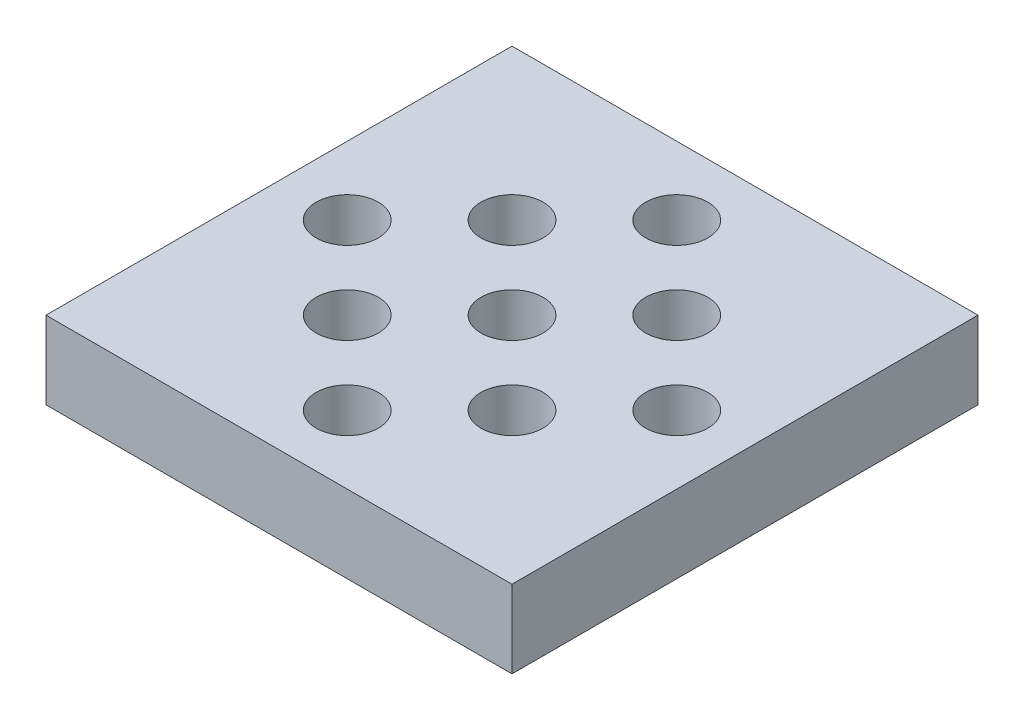
ISO-10303-21;
HEADER;
FILE_DESCRIPTION(('STEP AP214'),'2;1');
FILE_NAME('part.step','',(''),(''),'','','');
FILE_SCHEMA(('AUTOMOTIVE_DESIGN { 1 0 10303 214 1 1 1 1 }'));
ENDSEC;
DATA;
#1=APPLICATION_CONTEXT('core data for automotive mechanical design processes');
#2=APPLICATION_PROTOCOL_DEFINITION('international standard','automotive_design',2000,#1);
#3=PRODUCT_CONTEXT('',#1,'mechanical');
#4=PRODUCT('Part','Part','',(#3));
#5=PRODUCT_RELATED_PRODUCT_CATEGORY('part','',(#4));
#6=PRODUCT_DEFINITION_FORMATION('','',#4);
#7=PRODUCT_DEFINITION_CONTEXT('part definition',#1,'design');
#8=PRODUCT_DEFINITION('design','',#6,#7);
#9=PRODUCT_DEFINITION_SHAPE('','',#8);
#10=(LENGTH_UNIT() NAMED_UNIT(*) SI_UNIT(.MILLI.,.METRE.));
#11=(NAMED_UNIT(*) PLANE_ANGLE_UNIT() SI_UNIT($,.RADIAN.));
#12=(NAMED_UNIT(*) SI_UNIT($,.STERADIAN.) SOLID_ANGLE_UNIT());
#13=UNCERTAINTY_MEASURE_WITH_UNIT(LENGTH_MEASURE(1.E-05),#10,'distance_accuracy_value','');
#14=(GEOMETRIC_REPRESENTATION_CONTEXT(3) GLOBAL_UNCERTAINTY_ASSIGNED_CONTEXT((#13)) GLOBAL_UNIT_ASSIGNED_CONTEXT((#10,
#11,#12)) REPRESENTATION_CONTEXT('',''));
#15=CARTESIAN_POINT('',(0.,0.,0.));
#16=DIRECTION('',(0.,0.,1.));
#17=DIRECTION('',(1.,0.,0.));
#18=AXIS2_PLACEMENT_3D('',#15,#16,#17);
#19=CARTESIAN_POINT('',(0.,10.,21.2132034355964));
#20=DIRECTION('',(0.,-1.,0.));
#21=DIRECTION('',(0.,0.,-1.));
#22=AXIS2_PLACEMENT_3D('',#19,#20,#21);
#23=CYLINDRICAL_SURFACE('',#22,4.);
#24=CARTESIAN_POINT('',(0.,10.,21.2132034355964));
#25=DIRECTION('',(0.,-1.,0.));
#26=DIRECTION('',(0.,0.,-1.));
#27=AXIS2_PLACEMENT_3D('',#24,#25,#26);
#28=CIRCLE('',#27,4.);
#29=CARTESIAN_POINT('',(0.,10.,17.2132034355964));
#30=VERTEX_POINT('',#29);
#31=EDGE_CURVE('E46',#30,#30,#28,.T.);
#32=ORIENTED_EDGE('',*,*,#31,.F.);
#33=EDGE_LOOP('',(#32));
#34=FACE_BOUND('',#33,.T.);
#35=CARTESIAN_POINT('',(0.,0.,21.2132034355964));
#36=DIRECTION('',(0.,-1.,0.));
#37=DIRECTION('',(0.,0.,-1.));
#38=AXIS2_PLACEMENT_3D('',#35,#36,#37);
#39=CIRCLE('',#38,4.);
#40=CARTESIAN_POINT('',(0.,0.,17.2132034355964));
#41=VERTEX_POINT('',#40);
#42=EDGE_CURVE('E11',#41,#41,#39,.T.);
#43=ORIENTED_EDGE('',*,*,#42,.T.);
#44=EDGE_LOOP('',(#43));
#45=FACE_BOUND('',#44,.T.);
#46=ADVANCED_FACE('F38',(#34,#45),#23,.F.);
#47=CARTESIAN_POINT('',(10.6066017177982,10.,10.6066017177982));
#48=DIRECTION('',(0.,-1.,0.));
#49=DIRECTION('',(0.,0.,-1.));
#50=AXIS2_PLACEMENT_3D('',#47,#48,#49);
#51=CYLINDRICAL_SURFACE('',#50,4.);
#52=CARTESIAN_POINT('',(10.6066017177982,10.,10.6066017177982));
#53=DIRECTION('',(0.,-1.,0.));
#54=DIRECTION('',(0.,0.,-1.));
#55=AXIS2_PLACEMENT_3D('',#52,#53,#54);
#56=CIRCLE('',#55,4.);
#57=CARTESIAN_POINT('',(10.6066017177982,10.,6.60660171779822));
#58=VERTEX_POINT('',#57);
#59=EDGE_CURVE('E151',#58,#58,#56,.T.);
#60=ORIENTED_EDGE('',*,*,#59,.F.);
#61=EDGE_LOOP('',(#60));
#62=FACE_BOUND('',#61,.T.);
#63=CARTESIAN_POINT('',(10.6066017177982,0.,10.6066017177982));
#64=DIRECTION('',(0.,-1.,0.));
#65=DIRECTION('',(0.,0.,-1.));
#66=AXIS2_PLACEMENT_3D('',#63,#64,#65);
#67=CIRCLE('',#66,4.);
#68=CARTESIAN_POINT('',(10.6066017177982,0.,6.60660171779822));
#69=VERTEX_POINT('',#68);
#70=EDGE_CURVE('E154',#69,#69,#67,.T.);
#71=ORIENTED_EDGE('',*,*,#70,.T.);
#72=EDGE_LOOP('',(#71));
#73=FACE_BOUND('',#72,.T.);
#74=ADVANCED_FACE('F163',(#62,#73),#51,.F.);
#75=CARTESIAN_POINT('',(21.2132034355964,10.,0.));
#76=DIRECTION('',(0.,-1.,0.));
#77=DIRECTION('',(0.,0.,-1.));
#78=AXIS2_PLACEMENT_3D('',#75,#76,#77);
#79=CYLINDRICAL_SURFACE('',#78,4.);
#80=CARTESIAN_POINT('',(21.2132034355964,10.,0.));
#81=DIRECTION('',(0.,-1.,0.));
#82=DIRECTION('',(0.,0.,-1.));
#83=AXIS2_PLACEMENT_3D('',#80,#81,#82);
#84=CIRCLE('',#83,4.);
#85=CARTESIAN_POINT('',(21.2132034355964,10.,-3.99999999999999));
#86=VERTEX_POINT('',#85);
#87=EDGE_CURVE('E145',#86,#86,#84,.T.);
#88=ORIENTED_EDGE('',*,*,#87,.F.);
#89=EDGE_LOOP('',(#88));
#90=FACE_BOUND('',#89,.T.);
#91=CARTESIAN_POINT('',(21.2132034355964,0.,0.));
#92=DIRECTION('',(0.,-1.,0.));
#93=DIRECTION('',(0.,0.,-1.));
#94=AXIS2_PLACEMENT_3D('',#91,#92,#93);
#95=CIRCLE('',#94,4.);
#96=CARTESIAN_POINT('',(21.2132034355964,0.,-3.99999999999999));
#97=VERTEX_POINT('',#96);
#98=EDGE_CURVE('E148',#97,#97,#95,.T.);
#99=ORIENTED_EDGE('',*,*,#98,.T.);
#100=EDGE_LOOP('',(#99));
#101=FACE_BOUND('',#100,.T.);
#102=ADVANCED_FACE('F225',(#90,#101),#79,.F.);
#103=CARTESIAN_POINT('',(-10.6066017177982,10.,10.6066017177982));
#104=DIRECTION('',(0.,-1.,0.));
#105=DIRECTION('',(0.,0.,-1.));
#106=AXIS2_PLACEMENT_3D('',#103,#104,#105);
#107=CYLINDRICAL_SURFACE('',#106,4.);
#108=CARTESIAN_POINT('',(-10.6066017177982,10.,10.6066017177982));
#109=DIRECTION('',(0.,-1.,0.));
#110=DIRECTION('',(0.,0.,-1.));
#111=AXIS2_PLACEMENT_3D('',#108,#109,#110);
#112=CIRCLE('',#111,4.);
#113=CARTESIAN_POINT('',(-10.6066017177982,10.,6.60660171779822));
#114=VERTEX_POINT('',#113);
#115=EDGE_CURVE('E139',#114,#114,#112,.T.);
#116=ORIENTED_EDGE('',*,*,#115,.F.);
#117=EDGE_LOOP('',(#116));
#118=FACE_BOUND('',#117,.T.);
#119=CARTESIAN_POINT('',(-10.6066017177982,0.,10.6066017177982));
#120=DIRECTION('',(0.,-1.,0.));
#121=DIRECTION('',(0.,0.,-1.));
#122=AXIS2_PLACEMENT_3D('',#119,#120,#121);
#123=CIRCLE('',#122,4.);
#124=CARTESIAN_POINT('',(-10.6066017177982,0.,6.60660171779822));
#125=VERTEX_POINT('',#124);
#126=EDGE_CURVE('E142',#125,#125,#123,.T.);
#127=ORIENTED_EDGE('',*,*,#126,.T.);
#128=EDGE_LOOP('',(#127));
#129=FACE_BOUND('',#128,.T.);
#130=ADVANCED_FACE('F221',(#118,#129),#107,.F.);
#131=CARTESIAN_POINT('',(0.,10.,0.));
#132=DIRECTION('',(0.,-1.,0.));
#133=DIRECTION('',(0.,0.,-1.));
#134=AXIS2_PLACEMENT_3D('',#131,#132,#133);
#135=CYLINDRICAL_SURFACE('',#134,4.);
#136=CARTESIAN_POINT('',(0.,10.,0.));
#137=DIRECTION('',(0.,-1.,0.));
#138=DIRECTION('',(0.,0.,-1.));
#139=AXIS2_PLACEMENT_3D('',#136,#137,#138);
#140=CIRCLE('',#139,4.);
#141=CARTESIAN_POINT('',(0.,10.,-3.99999999999999));
#142=VERTEX_POINT('',#141);
#143=EDGE_CURVE('E133',#142,#142,#140,.T.);
#144=ORIENTED_EDGE('',*,*,#143,.F.);
#145=EDGE_LOOP('',(#144));
#146=FACE_BOUND('',#145,.T.);
#147=CARTESIAN_POINT('',(0.,0.,0.));
#148=DIRECTION('',(0.,-1.,0.));
#149=DIRECTION('',(0.,0.,-1.));
#150=AXIS2_PLACEMENT_3D('',#147,#148,#149);
#151=CIRCLE('',#150,4.);
#152=CARTESIAN_POINT('',(0.,0.,-3.99999999999999));
#153=VERTEX_POINT('',#152);
#154=EDGE_CURVE('E136',#153,#153,#151,.T.);
#155=ORIENTED_EDGE('',*,*,#154,.T.);
#156=EDGE_LOOP('',(#155));
#157=FACE_BOUND('',#156,.T.);
#158=ADVANCED_FACE('F217',(#146,#157),#135,.F.);
#159=CARTESIAN_POINT('',(10.6066017177982,10.,-10.6066017177982));
#160=DIRECTION('',(0.,-1.,0.));
#161=DIRECTION('',(0.,0.,-1.));
#162=AXIS2_PLACEMENT_3D('',#159,#160,#161);
#163=CYLINDRICAL_SURFACE('',#162,4.);
#164=CARTESIAN_POINT('',(10.6066017177982,10.,-10.6066017177982));
#165=DIRECTION('',(0.,-1.,0.));
#166=DIRECTION('',(0.,0.,-1.));
#167=AXIS2_PLACEMENT_3D('',#164,#165,#166);
#168=CIRCLE('',#167,4.);
#169=CARTESIAN_POINT('',(10.6066017177982,10.,-14.6066017177982));
#170=VERTEX_POINT('',#169);
#171=EDGE_CURVE('E127',#170,#170,#168,.T.);
#172=ORIENTED_EDGE('',*,*,#171,.F.);
#173=EDGE_LOOP('',(#172));
#174=FACE_BOUND('',#173,.T.);
#175=CARTESIAN_POINT('',(10.6066017177982,0.,-10.6066017177982));
#176=DIRECTION('',(0.,-1.,0.));
#177=DIRECTION('',(0.,0.,-1.));
#178=AXIS2_PLACEMENT_3D('',#175,#176,#177);
#179=CIRCLE('',#178,4.);
#180=CARTESIAN_POINT('',(10.6066017177982,0.,-14.6066017177982));
#181=VERTEX_POINT('',#180);
#182=EDGE_CURVE('E130',#181,#181,#179,.T.);
#183=ORIENTED_EDGE('',*,*,#182,.T.);
#184=EDGE_LOOP('',(#183));
#185=FACE_BOUND('',#184,.T.);
#186=ADVANCED_FACE('F213',(#174,#185),#163,.F.);
#187=CARTESIAN_POINT('',(-21.2132034355964,10.,0.));
#188=DIRECTION('',(0.,-1.,0.));
#189=DIRECTION('',(0.,0.,-1.));
#190=AXIS2_PLACEMENT_3D('',#187,#188,#189);
#191=CYLINDRICAL_SURFACE('',#190,4.);
#192=CARTESIAN_POINT('',(-21.2132034355964,10.,0.));
#193=DIRECTION('',(0.,-1.,0.));
#194=DIRECTION('',(0.,0.,-1.));
#195=AXIS2_PLACEMENT_3D('',#192,#193,#194);
#196=CIRCLE('',#195,4.);
#197=CARTESIAN_POINT('',(-21.2132034355964,10.,-4.));
#198=VERTEX_POINT('',#197);
#199=EDGE_CURVE('E121',#198,#198,#196,.T.);
#200=ORIENTED_EDGE('',*,*,#199,.F.);
#201=EDGE_LOOP('',(#200));
#202=FACE_BOUND('',#201,.T.);
#203=CARTESIAN_POINT('',(-21.2132034355964,0.,0.));
#204=DIRECTION('',(0.,-1.,0.));
#205=DIRECTION('',(0.,0.,-1.));
#206=AXIS2_PLACEMENT_3D('',#203,#204,#205);
#207=CIRCLE('',#206,4.);
#208=CARTESIAN_POINT('',(-21.2132034355964,0.,-4.));
#209=VERTEX_POINT('',#208);
#210=EDGE_CURVE('E124',#209,#209,#207,.T.);
#211=ORIENTED_EDGE('',*,*,#210,.T.);
#212=EDGE_LOOP('',(#211));
#213=FACE_BOUND('',#212,.T.);
#214=ADVANCED_FACE('F209',(#202,#213),#191,.F.);
#215=CARTESIAN_POINT('',(-10.6066017177982,10.,-10.6066017177982));
#216=DIRECTION('',(0.,-1.,0.));
#217=DIRECTION('',(0.,0.,-1.));
#218=AXIS2_PLACEMENT_3D('',#215,#216,#217);
#219=CYLINDRICAL_SURFACE('',#218,4.);
#220=CARTESIAN_POINT('',(-10.6066017177982,10.,-10.6066017177982));
#221=DIRECTION('',(0.,-1.,0.));
#222=DIRECTION('',(0.,0.,-1.));
#223=AXIS2_PLACEMENT_3D('',#220,#221,#222);
#224=CIRCLE('',#223,4.);
#225=CARTESIAN_POINT('',(-10.6066017177982,10.,-14.6066017177982));
#226=VERTEX_POINT('',#225);
#227=EDGE_CURVE('E115',#226,#226,#224,.T.);
#228=ORIENTED_EDGE('',*,*,#227,.F.);
#229=EDGE_LOOP('',(#228));
#230=FACE_BOUND('',#229,.T.);
#231=CARTESIAN_POINT('',(-10.6066017177982,0.,-10.6066017177982));
#232=DIRECTION('',(0.,-1.,0.));
#233=DIRECTION('',(0.,0.,-1.));
#234=AXIS2_PLACEMENT_3D('',#231,#232,#233);
#235=CIRCLE('',#234,4.);
#236=CARTESIAN_POINT('',(-10.6066017177982,0.,-14.6066017177982));
#237=VERTEX_POINT('',#236);
#238=EDGE_CURVE('E118',#237,#237,#235,.T.);
#239=ORIENTED_EDGE('',*,*,#238,.T.);
#240=EDGE_LOOP('',(#239));
#241=FACE_BOUND('',#240,.T.);
#242=ADVANCED_FACE('F206',(#230,#241),#219,.F.);
#243=CARTESIAN_POINT('',(-30.,10.,30.));
#244=DIRECTION('',(1.,0.,0.));
#245=DIRECTION('',(0.,0.,-1.));
#246=AXIS2_PLACEMENT_3D('',#243,#244,#245);
#247=PLANE('',#246);
#248=DIRECTION('',(0.,0.,1.));
#249=VECTOR('',#248,1.);
#250=CARTESIAN_POINT('',(-30.,0.,30.));
#251=LINE('',#250,#249);
#252=CARTESIAN_POINT('',(-30.,0.,-30.));
#253=VERTEX_POINT('',#252);
#254=CARTESIAN_POINT('',(-30.,0.,30.));
#255=VERTEX_POINT('',#254);
#256=EDGE_CURVE('E105',#253,#255,#251,.T.);
#257=ORIENTED_EDGE('',*,*,#256,.T.);
#258=DIRECTION('',(0.,-1.,0.));
#259=VECTOR('',#258,1.);
#260=CARTESIAN_POINT('',(-30.,10.,30.));
#261=LINE('',#260,#259);
#262=CARTESIAN_POINT('',(-30.,10.,30.));
#263=VERTEX_POINT('',#262);
#264=EDGE_CURVE('E96',#263,#255,#261,.T.);
#265=ORIENTED_EDGE('',*,*,#264,.F.);
#266=DIRECTION('',(0.,0.,1.));
#267=VECTOR('',#266,1.);
#268=CARTESIAN_POINT('',(-30.,10.,30.));
#269=LINE('',#268,#267);
#270=CARTESIAN_POINT('',(-30.,10.,-30.));
#271=VERTEX_POINT('',#270);
#272=EDGE_CURVE('E90',#271,#263,#269,.T.);
#273=ORIENTED_EDGE('',*,*,#272,.F.);
#274=DIRECTION('',(0.,-1.,0.));
#275=VECTOR('',#274,1.);
#276=CARTESIAN_POINT('',(-30.,10.,-30.));
#277=LINE('',#276,#275);
#278=EDGE_CURVE('E101',#271,#253,#277,.T.);
#279=ORIENTED_EDGE('',*,*,#278,.T.);
#280=EDGE_LOOP('',(#257,#265,#273,#279));
#281=FACE_BOUND('',#280,.T.);
#282=ADVANCED_FACE('F191',(#281),#247,.F.);
#283=CARTESIAN_POINT('',(30.,10.,30.));
#284=DIRECTION('',(0.,0.,-1.));
#285=DIRECTION('',(-1.,0.,0.));
#286=AXIS2_PLACEMENT_3D('',#283,#284,#285);
#287=PLANE('',#286);
#288=DIRECTION('',(1.,0.,0.));
#289=VECTOR('',#288,1.);
#290=CARTESIAN_POINT('',(30.,0.,30.));
#291=LINE('',#290,#289);
#292=CARTESIAN_POINT('',(30.,0.,30.));
#293=VERTEX_POINT('',#292);
#294=EDGE_CURVE('E95',#255,#293,#291,.T.);
#295=ORIENTED_EDGE('',*,*,#294,.T.);
#296=DIRECTION('',(0.,-1.,0.));
#297=VECTOR('',#296,1.);
#298=CARTESIAN_POINT('',(30.,10.,30.));
#299=LINE('',#298,#297);
#300=CARTESIAN_POINT('',(30.,10.,30.));
#301=VERTEX_POINT('',#300);
#302=EDGE_CURVE('E93',#301,#293,#299,.T.);
#303=ORIENTED_EDGE('',*,*,#302,.F.);
#304=DIRECTION('',(1.,0.,0.));
#305=VECTOR('',#304,1.);
#306=CARTESIAN_POINT('',(30.,10.,30.));
#307=LINE('',#306,#305);
#308=EDGE_CURVE('E85',#263,#301,#307,.T.);
#309=ORIENTED_EDGE('',*,*,#308,.F.);
#310=ORIENTED_EDGE('',*,*,#264,.T.);
#311=EDGE_LOOP('',(#295,#303,#309,#310));
#312=FACE_BOUND('',#311,.T.);
#313=ADVANCED_FACE('F94',(#312),#287,.F.);
#314=CARTESIAN_POINT('',(30.,10.,30.));
#315=DIRECTION('',(-1.,0.,0.));
#316=DIRECTION('',(0.,0.,1.));
#317=AXIS2_PLACEMENT_3D('',#314,#315,#316);
#318=PLANE('',#317);
#319=DIRECTION('',(0.,0.,-1.));
#320=VECTOR('',#319,1.);
#321=CARTESIAN_POINT('',(30.,0.,30.));
#322=LINE('',#321,#320);
#323=CARTESIAN_POINT('',(30.,0.,-30.));
#324=VERTEX_POINT('',#323);
#325=EDGE_CURVE('E71',#293,#324,#322,.T.);
#326=ORIENTED_EDGE('',*,*,#325,.T.);
#327=DIRECTION('',(0.,-1.,0.));
#328=VECTOR('',#327,1.);
#329=CARTESIAN_POINT('',(30.,10.,-30.));
#330=LINE('',#329,#328);
#331=CARTESIAN_POINT('',(30.,10.,-30.));
#332=VERTEX_POINT('',#331);
#333=EDGE_CURVE('E97',#332,#324,#330,.T.);
#334=ORIENTED_EDGE('',*,*,#333,.F.);
#335=DIRECTION('',(0.,0.,-1.));
#336=VECTOR('',#335,1.);
#337=CARTESIAN_POINT('',(30.,10.,30.));
#338=LINE('',#337,#336);
#339=EDGE_CURVE('E88',#301,#332,#338,.T.);
#340=ORIENTED_EDGE('',*,*,#339,.F.);
#341=ORIENTED_EDGE('',*,*,#302,.T.);
#342=EDGE_LOOP('',(#326,#334,#340,#341));
#343=FACE_BOUND('',#342,.T.);
#344=ADVANCED_FACE('F99',(#343),#318,.F.);
#345=CARTESIAN_POINT('',(30.,10.,-30.));
#346=DIRECTION('',(0.,0.,1.));
#347=DIRECTION('',(1.,0.,0.));
#348=AXIS2_PLACEMENT_3D('',#345,#346,#347);
#349=PLANE('',#348);
#350=DIRECTION('',(-1.,0.,0.));
#351=VECTOR('',#350,1.);
#352=CARTESIAN_POINT('',(30.,0.,-30.));
#353=LINE('',#352,#351);
#354=EDGE_CURVE('E77',#324,#253,#353,.T.);
#355=ORIENTED_EDGE('',*,*,#354,.T.);
#356=ORIENTED_EDGE('',*,*,#278,.F.);
#357=DIRECTION('',(-1.,0.,0.));
#358=VECTOR('',#357,1.);
#359=CARTESIAN_POINT('',(30.,10.,-30.));
#360=LINE('',#359,#358);
#361=EDGE_CURVE('E54',#332,#271,#360,.T.);
#362=ORIENTED_EDGE('',*,*,#361,.F.);
#363=ORIENTED_EDGE('',*,*,#333,.T.);
#364=EDGE_LOOP('',(#355,#356,#362,#363));
#365=FACE_BOUND('',#364,.T.);
#366=ADVANCED_FACE('F192',(#365),#349,.F.);
#367=CARTESIAN_POINT('',(0.,10.,0.));
#368=DIRECTION('',(0.,1.,0.));
#369=DIRECTION('',(0.,0.,1.));
#370=AXIS2_PLACEMENT_3D('',#367,#368,#369);
#371=PLANE('',#370);
#372=ORIENTED_EDGE('',*,*,#31,.T.);
#373=EDGE_LOOP('',(#372));
#374=FACE_BOUND('',#373,.T.);
#375=ORIENTED_EDGE('',*,*,#59,.T.);
#376=EDGE_LOOP('',(#375));
#377=FACE_BOUND('',#376,.T.);
#378=ORIENTED_EDGE('',*,*,#87,.T.);
#379=EDGE_LOOP('',(#378));
#380=FACE_BOUND('',#379,.T.);
#381=ORIENTED_EDGE('',*,*,#115,.T.);
#382=EDGE_LOOP('',(#381));
#383=FACE_BOUND('',#382,.T.);
#384=ORIENTED_EDGE('',*,*,#143,.T.);
#385=EDGE_LOOP('',(#384));
#386=FACE_BOUND('',#385,.T.);
#387=ORIENTED_EDGE('',*,*,#171,.T.);
#388=EDGE_LOOP('',(#387));
#389=FACE_BOUND('',#388,.T.);
#390=ORIENTED_EDGE('',*,*,#199,.T.);
#391=EDGE_LOOP('',(#390));
#392=FACE_BOUND('',#391,.T.);
#393=ORIENTED_EDGE('',*,*,#227,.T.);
#394=EDGE_LOOP('',(#393));
#395=FACE_BOUND('',#394,.T.);
#396=CARTESIAN_POINT('',(0.,10.,-21.2132034355964));
#397=DIRECTION('',(0.,-1.,0.));
#398=DIRECTION('',(0.,0.,-1.));
#399=AXIS2_PLACEMENT_3D('',#396,#397,#398);
#400=CIRCLE('',#399,4.);
#401=CARTESIAN_POINT('',(0.,10.,-25.2132034355964));
#402=VERTEX_POINT('',#401);
#403=EDGE_CURVE('E108',#402,#402,#400,.T.);
#404=ORIENTED_EDGE('',*,*,#403,.T.);
#405=EDGE_LOOP('',(#404));
#406=FACE_BOUND('',#405,.T.);
#407=ORIENTED_EDGE('',*,*,#272,.T.);
#408=ORIENTED_EDGE('',*,*,#308,.T.);
#409=ORIENTED_EDGE('',*,*,#339,.T.);
#410=ORIENTED_EDGE('',*,*,#361,.T.);
#411=EDGE_LOOP('',(#407,#408,#409,#410));
#412=FACE_BOUND('',#411,.T.);
#413=ADVANCED_FACE('F86',(#374,#377,#380,#383,#386,#389,#392,#395,#406,#412),#371,.T.);
#414=CARTESIAN_POINT('',(0.,0.,0.));
#415=DIRECTION('',(0.,1.,0.));
#416=DIRECTION('',(0.,0.,1.));
#417=AXIS2_PLACEMENT_3D('',#414,#415,#416);
#418=PLANE('',#417);
#419=ORIENTED_EDGE('',*,*,#42,.F.);
#420=EDGE_LOOP('',(#419));
#421=FACE_BOUND('',#420,.T.);
#422=ORIENTED_EDGE('',*,*,#70,.F.);
#423=EDGE_LOOP('',(#422));
#424=FACE_BOUND('',#423,.T.);
#425=ORIENTED_EDGE('',*,*,#98,.F.);
#426=EDGE_LOOP('',(#425));
#427=FACE_BOUND('',#426,.T.);
#428=ORIENTED_EDGE('',*,*,#126,.F.);
#429=EDGE_LOOP('',(#428));
#430=FACE_BOUND('',#429,.T.);
#431=ORIENTED_EDGE('',*,*,#154,.F.);
#432=EDGE_LOOP('',(#431));
#433=FACE_BOUND('',#432,.T.);
#434=ORIENTED_EDGE('',*,*,#182,.F.);
#435=EDGE_LOOP('',(#434));
#436=FACE_BOUND('',#435,.T.);
#437=ORIENTED_EDGE('',*,*,#210,.F.);
#438=EDGE_LOOP('',(#437));
#439=FACE_BOUND('',#438,.T.);
#440=ORIENTED_EDGE('',*,*,#238,.F.);
#441=EDGE_LOOP('',(#440));
#442=FACE_BOUND('',#441,.T.);
#443=CARTESIAN_POINT('',(0.,0.,-21.2132034355964));
#444=DIRECTION('',(0.,-1.,0.));
#445=DIRECTION('',(0.,0.,-1.));
#446=AXIS2_PLACEMENT_3D('',#443,#444,#445);
#447=CIRCLE('',#446,4.);
#448=CARTESIAN_POINT('',(0.,0.,-25.2132034355964));
#449=VERTEX_POINT('',#448);
#450=EDGE_CURVE('E188',#449,#449,#447,.T.);
#451=ORIENTED_EDGE('',*,*,#450,.F.);
#452=EDGE_LOOP('',(#451));
#453=FACE_BOUND('',#452,.T.);
#454=ORIENTED_EDGE('',*,*,#256,.F.);
#455=ORIENTED_EDGE('',*,*,#354,.F.);
#456=ORIENTED_EDGE('',*,*,#325,.F.);
#457=ORIENTED_EDGE('',*,*,#294,.F.);
#458=EDGE_LOOP('',(#454,#455,#456,#457));
#459=FACE_BOUND('',#458,.T.);
#460=ADVANCED_FACE('F166',(#421,#424,#427,#430,#433,#436,#439,#442,#453,#459),#418,.F.);
#461=CARTESIAN_POINT('',(0.,10.,-21.2132034355964));
#462=DIRECTION('',(0.,-1.,0.));
#463=DIRECTION('',(0.,0.,-1.));
#464=AXIS2_PLACEMENT_3D('',#461,#462,#463);
#465=CYLINDRICAL_SURFACE('',#464,4.);
#466=ORIENTED_EDGE('',*,*,#403,.F.);
#467=EDGE_LOOP('',(#466));
#468=FACE_BOUND('',#467,.T.);
#469=ORIENTED_EDGE('',*,*,#450,.T.);
#470=EDGE_LOOP('',(#469));
#471=FACE_BOUND('',#470,.T.);
#472=ADVANCED_FACE('F169',(#468,#471),#465,.F.);
#473=CLOSED_SHELL('',(#46,#74,#102,#130,#158,#186,#214,#242,#282,#313,#344,#366,#413,#460,#472));
#474=MANIFOLD_SOLID_BREP('B2',#473);
#475=ADVANCED_BREP_SHAPE_REPRESENTATION('',(#18,#474),#14);
#476=SHAPE_DEFINITION_REPRESENTATION(#9,#475);
ENDSEC;
END-ISO-10303-21;
